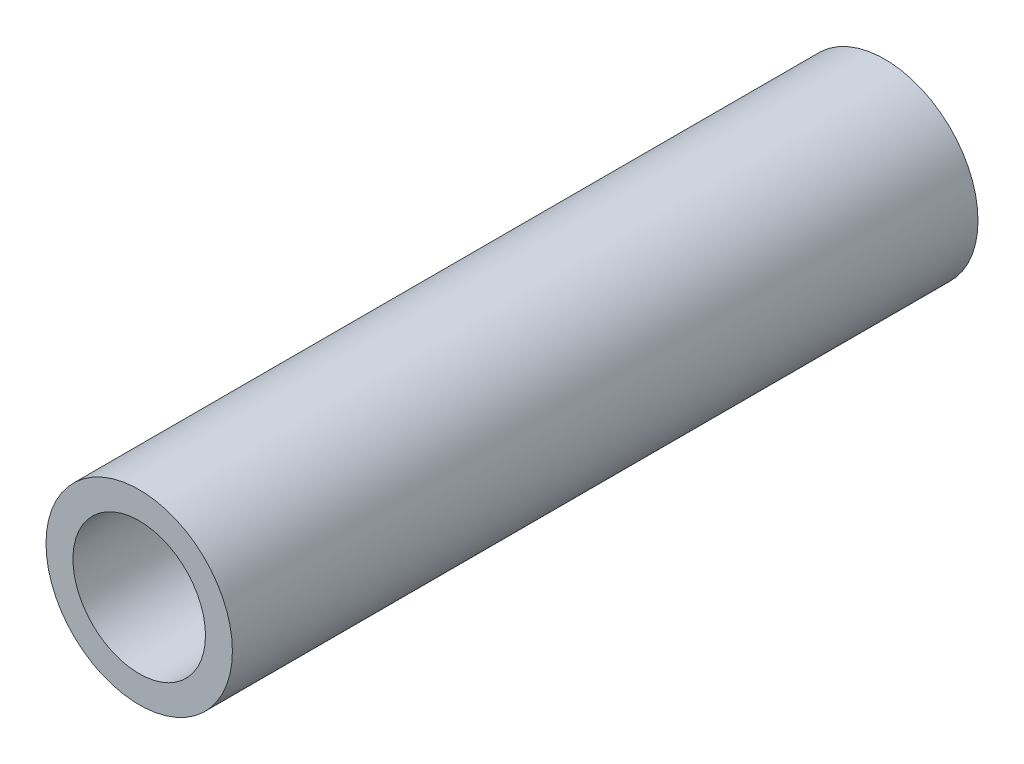
ISO-10303-21;
HEADER;
FILE_DESCRIPTION(('STEP AP214'),'2;1');
FILE_NAME('part.step','',(''),(''),'','','');
FILE_SCHEMA(('AUTOMOTIVE_DESIGN { 1 0 10303 214 1 1 1 1 }'));
ENDSEC;
DATA;
#1=APPLICATION_CONTEXT('core data for automotive mechanical design processes');
#2=APPLICATION_PROTOCOL_DEFINITION('international standard','automotive_design',2000,#1);
#3=PRODUCT_CONTEXT('',#1,'mechanical');
#4=PRODUCT('Part','Part','',(#3));
#5=PRODUCT_RELATED_PRODUCT_CATEGORY('part','',(#4));
#6=PRODUCT_DEFINITION_FORMATION('','',#4);
#7=PRODUCT_DEFINITION_CONTEXT('part definition',#1,'design');
#8=PRODUCT_DEFINITION('design','',#6,#7);
#9=PRODUCT_DEFINITION_SHAPE('','',#8);
#10=(LENGTH_UNIT() NAMED_UNIT(*) SI_UNIT(.MILLI.,.METRE.));
#11=(NAMED_UNIT(*) PLANE_ANGLE_UNIT() SI_UNIT($,.RADIAN.));
#12=(NAMED_UNIT(*) SI_UNIT($,.STERADIAN.) SOLID_ANGLE_UNIT());
#13=UNCERTAINTY_MEASURE_WITH_UNIT(LENGTH_MEASURE(1.E-05),#10,'distance_accuracy_value','');
#14=(GEOMETRIC_REPRESENTATION_CONTEXT(3) GLOBAL_UNCERTAINTY_ASSIGNED_CONTEXT((#13)) GLOBAL_UNIT_ASSIGNED_CONTEXT((#10,
#11,#12)) REPRESENTATION_CONTEXT('',''));
#15=CARTESIAN_POINT('',(0.,0.,0.));
#16=DIRECTION('',(0.,0.,1.));
#17=DIRECTION('',(1.,0.,0.));
#18=AXIS2_PLACEMENT_3D('',#15,#16,#17);
#19=CARTESIAN_POINT('',(0.,0.,9.));
#20=DIRECTION('',(0.,0.,1.));
#21=DIRECTION('',(1.,0.,0.));
#22=AXIS2_PLACEMENT_3D('',#19,#20,#21);
#23=PLANE('',#22);
#24=CARTESIAN_POINT('',(0.,0.,9.));
#25=DIRECTION('',(0.,0.,1.));
#26=DIRECTION('',(1.,0.,0.));
#27=AXIS2_PLACEMENT_3D('',#24,#25,#26);
#28=CIRCLE('',#27,2.25);
#29=CARTESIAN_POINT('',(2.25,0.,9.));
#30=VERTEX_POINT('',#29);
#31=EDGE_CURVE('E10',#30,#30,#28,.T.);
#32=ORIENTED_EDGE('',*,*,#31,.T.);
#33=EDGE_LOOP('',(#32));
#34=FACE_BOUND('',#33,.T.);
#35=CARTESIAN_POINT('',(0.,0.,9.));
#36=DIRECTION('',(0.,0.,1.));
#37=DIRECTION('',(1.,0.,0.));
#38=AXIS2_PLACEMENT_3D('',#35,#36,#37);
#39=CIRCLE('',#38,1.6);
#40=CARTESIAN_POINT('',(1.6,0.,9.));
#41=VERTEX_POINT('',#40);
#42=EDGE_CURVE('E50',#41,#41,#39,.T.);
#43=ORIENTED_EDGE('',*,*,#42,.F.);
#44=EDGE_LOOP('',(#43));
#45=FACE_BOUND('',#44,.T.);
#46=ADVANCED_FACE('F37',(#34,#45),#23,.T.);
#47=CARTESIAN_POINT('',(0.,0.,-9.));
#48=DIRECTION('',(0.,0.,1.));
#49=DIRECTION('',(1.,0.,0.));
#50=AXIS2_PLACEMENT_3D('',#47,#48,#49);
#51=PLANE('',#50);
#52=CARTESIAN_POINT('',(0.,0.,-9.));
#53=DIRECTION('',(0.,0.,1.));
#54=DIRECTION('',(1.,0.,0.));
#55=AXIS2_PLACEMENT_3D('',#52,#53,#54);
#56=CIRCLE('',#55,2.25);
#57=CARTESIAN_POINT('',(2.25,0.,-9.));
#58=VERTEX_POINT('',#57);
#59=EDGE_CURVE('E41',#58,#58,#56,.T.);
#60=ORIENTED_EDGE('',*,*,#59,.F.);
#61=EDGE_LOOP('',(#60));
#62=FACE_BOUND('',#61,.T.);
#63=CARTESIAN_POINT('',(0.,0.,-9.));
#64=DIRECTION('',(0.,0.,1.));
#65=DIRECTION('',(1.,0.,0.));
#66=AXIS2_PLACEMENT_3D('',#63,#64,#65);
#67=CIRCLE('',#66,1.6);
#68=CARTESIAN_POINT('',(1.6,0.,-9.));
#69=VERTEX_POINT('',#68);
#70=EDGE_CURVE('E52',#69,#69,#67,.T.);
#71=ORIENTED_EDGE('',*,*,#70,.T.);
#72=EDGE_LOOP('',(#71));
#73=FACE_BOUND('',#72,.T.);
#74=ADVANCED_FACE('F64',(#62,#73),#51,.F.);
#75=CARTESIAN_POINT('',(0.,0.,9.));
#76=DIRECTION('',(0.,0.,-1.));
#77=DIRECTION('',(-1.,0.,0.));
#78=AXIS2_PLACEMENT_3D('',#75,#76,#77);
#79=CYLINDRICAL_SURFACE('',#78,2.25);
#80=ORIENTED_EDGE('',*,*,#31,.F.);
#81=EDGE_LOOP('',(#80));
#82=FACE_BOUND('',#81,.T.);
#83=ORIENTED_EDGE('',*,*,#59,.T.);
#84=EDGE_LOOP('',(#83));
#85=FACE_BOUND('',#84,.T.);
#86=ADVANCED_FACE('F39',(#82,#85),#79,.T.);
#87=CARTESIAN_POINT('',(0.,0.,9.));
#88=DIRECTION('',(0.,0.,-1.));
#89=DIRECTION('',(-1.,0.,0.));
#90=AXIS2_PLACEMENT_3D('',#87,#88,#89);
#91=CYLINDRICAL_SURFACE('',#90,1.6);
#92=ORIENTED_EDGE('',*,*,#42,.T.);
#93=EDGE_LOOP('',(#92));
#94=FACE_BOUND('',#93,.T.);
#95=ORIENTED_EDGE('',*,*,#70,.F.);
#96=EDGE_LOOP('',(#95));
#97=FACE_BOUND('',#96,.T.);
#98=ADVANCED_FACE('F60',(#94,#97),#91,.F.);
#99=CLOSED_SHELL('',(#46,#74,#86,#98));
#100=MANIFOLD_SOLID_BREP('B2',#99);
#101=ADVANCED_BREP_SHAPE_REPRESENTATION('',(#18,#100),#14);
#102=SHAPE_DEFINITION_REPRESENTATION(#9,#101);
ENDSEC;
END-ISO-10303-21;
